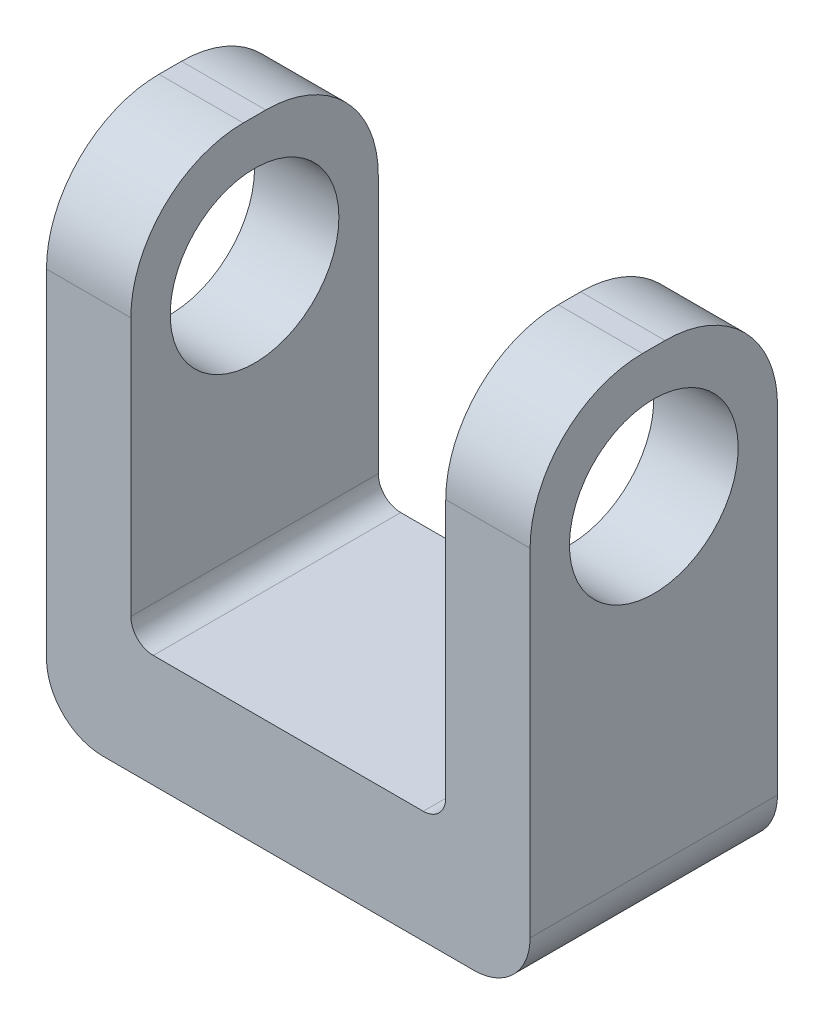
ISO-10303-21;
HEADER;
FILE_DESCRIPTION(('STEP AP214'),'2;1');
FILE_NAME('part.step','',(''),(''),'','','');
FILE_SCHEMA(('AUTOMOTIVE_DESIGN { 1 0 10303 214 1 1 1 1 }'));
ENDSEC;
DATA;
#1=APPLICATION_CONTEXT('core data for automotive mechanical design processes');
#2=APPLICATION_PROTOCOL_DEFINITION('international standard','automotive_design',2000,#1);
#3=PRODUCT_CONTEXT('',#1,'mechanical');
#4=PRODUCT('Part','Part','',(#3));
#5=PRODUCT_RELATED_PRODUCT_CATEGORY('part','',(#4));
#6=PRODUCT_DEFINITION_FORMATION('','',#4);
#7=PRODUCT_DEFINITION_CONTEXT('part definition',#1,'design');
#8=PRODUCT_DEFINITION('design','',#6,#7);
#9=PRODUCT_DEFINITION_SHAPE('','',#8);
#10=(LENGTH_UNIT() NAMED_UNIT(*) SI_UNIT(.MILLI.,.METRE.));
#11=(NAMED_UNIT(*) PLANE_ANGLE_UNIT() SI_UNIT($,.RADIAN.));
#12=(NAMED_UNIT(*) SI_UNIT($,.STERADIAN.) SOLID_ANGLE_UNIT());
#13=UNCERTAINTY_MEASURE_WITH_UNIT(LENGTH_MEASURE(1.E-05),#10,'distance_accuracy_value','');
#14=(GEOMETRIC_REPRESENTATION_CONTEXT(3) GLOBAL_UNCERTAINTY_ASSIGNED_CONTEXT((#13)) GLOBAL_UNIT_ASSIGNED_CONTEXT((#10,
#11,#12)) REPRESENTATION_CONTEXT('',''));
#15=CARTESIAN_POINT('',(0.,0.,0.));
#16=DIRECTION('',(0.,0.,1.));
#17=DIRECTION('',(1.,0.,0.));
#18=AXIS2_PLACEMENT_3D('',#15,#16,#17);
#19=CARTESIAN_POINT('',(-21.5,45.,22.));
#20=DIRECTION('',(0.,-1.,0.));
#21=DIRECTION('',(1.,0.,0.));
#22=AXIS2_PLACEMENT_3D('',#19,#20,#21);
#23=PLANE('',#22);
#24=DIRECTION('',(0.,0.,-1.));
#25=VECTOR('',#24,1.);
#26=CARTESIAN_POINT('',(14.,45.,63.));
#27=LINE('',#26,#25);
#28=CARTESIAN_POINT('',(14.,45.,12.));
#29=VERTEX_POINT('',#28);
#30=CARTESIAN_POINT('',(14.,45.,10.));
#31=VERTEX_POINT('',#30);
#32=EDGE_CURVE('E293',#29,#31,#27,.T.);
#33=ORIENTED_EDGE('',*,*,#32,.F.);
#34=DIRECTION('',(-1.,0.,0.));
#35=VECTOR('',#34,1.);
#36=CARTESIAN_POINT('',(-21.5,45.,12.));
#37=LINE('',#36,#35);
#38=CARTESIAN_POINT('',(21.5,45.,12.));
#39=VERTEX_POINT('',#38);
#40=EDGE_CURVE('E169',#29,#39,#37,.F.);
#41=ORIENTED_EDGE('',*,*,#40,.T.);
#42=DIRECTION('',(0.,0.,-1.));
#43=VECTOR('',#42,1.);
#44=CARTESIAN_POINT('',(21.5,45.,22.));
#45=LINE('',#44,#43);
#46=CARTESIAN_POINT('',(21.5,45.,10.));
#47=VERTEX_POINT('',#46);
#48=EDGE_CURVE('E181',#39,#47,#45,.T.);
#49=ORIENTED_EDGE('',*,*,#48,.T.);
#50=DIRECTION('',(-1.,0.,0.));
#51=VECTOR('',#50,1.);
#52=CARTESIAN_POINT('',(14.,45.,10.));
#53=LINE('',#52,#51);
#54=EDGE_CURVE('E170',#47,#31,#53,.T.);
#55=ORIENTED_EDGE('',*,*,#54,.T.);
#56=EDGE_LOOP('',(#33,#41,#49,#55));
#57=FACE_BOUND('',#56,.T.);
#58=ADVANCED_FACE('F34',(#57),#23,.F.);
#59=DIRECTION('',(0.,0.,-1.));
#60=VECTOR('',#59,1.);
#61=CARTESIAN_POINT('',(-21.5,45.,22.));
#62=LINE('',#61,#60);
#63=CARTESIAN_POINT('',(-21.5,45.,12.));
#64=VERTEX_POINT('',#63);
#65=CARTESIAN_POINT('',(-21.5,45.,10.));
#66=VERTEX_POINT('',#65);
#67=EDGE_CURVE('E263',#64,#66,#62,.T.);
#68=ORIENTED_EDGE('',*,*,#67,.F.);
#69=DIRECTION('',(-1.,0.,0.));
#70=VECTOR('',#69,1.);
#71=CARTESIAN_POINT('',(-21.5,45.,12.));
#72=LINE('',#71,#70);
#73=CARTESIAN_POINT('',(-14.,45.,12.));
#74=VERTEX_POINT('',#73);
#75=EDGE_CURVE('E199',#64,#74,#72,.F.);
#76=ORIENTED_EDGE('',*,*,#75,.T.);
#77=DIRECTION('',(0.,0.,-1.));
#78=VECTOR('',#77,1.);
#79=CARTESIAN_POINT('',(-14.,45.,63.));
#80=LINE('',#79,#78);
#81=CARTESIAN_POINT('',(-14.,45.,10.));
#82=VERTEX_POINT('',#81);
#83=EDGE_CURVE('E290',#74,#82,#80,.T.);
#84=ORIENTED_EDGE('',*,*,#83,.T.);
#85=DIRECTION('',(-1.,0.,0.));
#86=VECTOR('',#85,1.);
#87=CARTESIAN_POINT('',(-21.5,45.,10.));
#88=LINE('',#87,#86);
#89=EDGE_CURVE('E196',#82,#66,#88,.T.);
#90=ORIENTED_EDGE('',*,*,#89,.T.);
#91=EDGE_LOOP('',(#68,#76,#84,#90));
#92=FACE_BOUND('',#91,.T.);
#93=ADVANCED_FACE('F335',(#92),#23,.F.);
#94=CARTESIAN_POINT('',(0.,0.,22.));
#95=DIRECTION('',(0.,0.,-1.));
#96=DIRECTION('',(-1.,0.,0.));
#97=AXIS2_PLACEMENT_3D('',#94,#95,#96);
#98=PLANE('',#97);
#99=DIRECTION('',(0.,-1.,0.));
#100=VECTOR('',#99,1.);
#101=CARTESIAN_POINT('',(-21.5,0.,22.));
#102=LINE('',#101,#100);
#103=CARTESIAN_POINT('',(-21.5,35.,22.));
#104=VERTEX_POINT('',#103);
#105=CARTESIAN_POINT('',(-21.5,5.,22.));
#106=VERTEX_POINT('',#105);
#107=EDGE_CURVE('E240',#104,#106,#102,.T.);
#108=ORIENTED_EDGE('',*,*,#107,.T.);
#109=CARTESIAN_POINT('',(-16.5,5.,22.));
#110=DIRECTION('',(0.,0.,-1.));
#111=DIRECTION('',(-1.,0.,0.));
#112=AXIS2_PLACEMENT_3D('',#109,#110,#111);
#113=CIRCLE('',#112,5.);
#114=CARTESIAN_POINT('',(-16.5,0.,22.));
#115=VERTEX_POINT('',#114);
#116=EDGE_CURVE('E42',#106,#115,#113,.F.);
#117=ORIENTED_EDGE('',*,*,#116,.T.);
#118=DIRECTION('',(1.,0.,0.));
#119=VECTOR('',#118,1.);
#120=CARTESIAN_POINT('',(-21.5,0.,22.));
#121=LINE('',#120,#119);
#122=CARTESIAN_POINT('',(16.5,0.,22.));
#123=VERTEX_POINT('',#122);
#124=EDGE_CURVE('E239',#115,#123,#121,.T.);
#125=ORIENTED_EDGE('',*,*,#124,.T.);
#126=CARTESIAN_POINT('',(16.5,5.00000000000001,22.));
#127=DIRECTION('',(0.,0.,-1.));
#128=DIRECTION('',(-1.,0.,0.));
#129=AXIS2_PLACEMENT_3D('',#126,#127,#128);
#130=CIRCLE('',#129,5.);
#131=CARTESIAN_POINT('',(21.5,5.00000000000001,22.));
#132=VERTEX_POINT('',#131);
#133=EDGE_CURVE('E49',#123,#132,#130,.F.);
#134=ORIENTED_EDGE('',*,*,#133,.T.);
#135=DIRECTION('',(0.,1.,0.));
#136=VECTOR('',#135,1.);
#137=CARTESIAN_POINT('',(21.5,0.,22.));
#138=LINE('',#137,#136);
#139=CARTESIAN_POINT('',(21.5,35.,22.));
#140=VERTEX_POINT('',#139);
#141=EDGE_CURVE('E174',#132,#140,#138,.T.);
#142=ORIENTED_EDGE('',*,*,#141,.T.);
#143=DIRECTION('',(-1.,0.,0.));
#144=VECTOR('',#143,1.);
#145=CARTESIAN_POINT('',(0.,35.,22.));
#146=LINE('',#145,#144);
#147=CARTESIAN_POINT('',(14.,35.,22.));
#148=VERTEX_POINT('',#147);
#149=EDGE_CURVE('E168',#140,#148,#146,.T.);
#150=ORIENTED_EDGE('',*,*,#149,.T.);
#151=DIRECTION('',(0.,1.,0.));
#152=VECTOR('',#151,1.);
#153=CARTESIAN_POINT('',(14.,0.,22.));
#154=LINE('',#153,#152);
#155=CARTESIAN_POINT('',(14.,12.,22.));
#156=VERTEX_POINT('',#155);
#157=EDGE_CURVE('E149',#156,#148,#154,.T.);
#158=ORIENTED_EDGE('',*,*,#157,.F.);
#159=CARTESIAN_POINT('',(12.,12.,22.));
#160=DIRECTION('',(0.,0.,-1.));
#161=DIRECTION('',(-1.,0.,0.));
#162=AXIS2_PLACEMENT_3D('',#159,#160,#161);
#163=CIRCLE('',#162,2.);
#164=CARTESIAN_POINT('',(12.,10.,22.));
#165=VERTEX_POINT('',#164);
#166=EDGE_CURVE('E221',#156,#165,#163,.T.);
#167=ORIENTED_EDGE('',*,*,#166,.T.);
#168=DIRECTION('',(1.,0.,0.));
#169=VECTOR('',#168,1.);
#170=CARTESIAN_POINT('',(0.,10.,22.));
#171=LINE('',#170,#169);
#172=CARTESIAN_POINT('',(-12.,9.99999999999999,22.));
#173=VERTEX_POINT('',#172);
#174=EDGE_CURVE('E295',#173,#165,#171,.T.);
#175=ORIENTED_EDGE('',*,*,#174,.F.);
#176=CARTESIAN_POINT('',(-12.,12.,22.));
#177=DIRECTION('',(0.,0.,-1.));
#178=DIRECTION('',(-1.,0.,0.));
#179=AXIS2_PLACEMENT_3D('',#176,#177,#178);
#180=CIRCLE('',#179,2.);
#181=CARTESIAN_POINT('',(-14.,12.,22.));
#182=VERTEX_POINT('',#181);
#183=EDGE_CURVE('E225',#173,#182,#180,.T.);
#184=ORIENTED_EDGE('',*,*,#183,.T.);
#185=DIRECTION('',(0.,-1.,0.));
#186=VECTOR('',#185,1.);
#187=CARTESIAN_POINT('',(-14.,0.,22.));
#188=LINE('',#187,#186);
#189=CARTESIAN_POINT('',(-14.,35.,22.));
#190=VERTEX_POINT('',#189);
#191=EDGE_CURVE('E161',#190,#182,#188,.T.);
#192=ORIENTED_EDGE('',*,*,#191,.F.);
#193=DIRECTION('',(-1.,0.,0.));
#194=VECTOR('',#193,1.);
#195=CARTESIAN_POINT('',(0.,35.,22.));
#196=LINE('',#195,#194);
#197=EDGE_CURVE('E176',#190,#104,#196,.T.);
#198=ORIENTED_EDGE('',*,*,#197,.T.);
#199=EDGE_LOOP('',(#108,#117,#125,#134,#142,#150,#158,#167,#175,#184,#192,#198));
#200=FACE_BOUND('',#199,.T.);
#201=ADVANCED_FACE('F173',(#200),#98,.F.);
#202=CARTESIAN_POINT('',(0.,0.,0.));
#203=DIRECTION('',(0.,0.,-1.));
#204=DIRECTION('',(-1.,0.,0.));
#205=AXIS2_PLACEMENT_3D('',#202,#203,#204);
#206=PLANE('',#205);
#207=DIRECTION('',(1.,0.,0.));
#208=VECTOR('',#207,1.);
#209=CARTESIAN_POINT('',(-21.5,0.,0.));
#210=LINE('',#209,#208);
#211=CARTESIAN_POINT('',(-16.5,0.,0.));
#212=VERTEX_POINT('',#211);
#213=CARTESIAN_POINT('',(16.5,0.,0.));
#214=VERTEX_POINT('',#213);
#215=EDGE_CURVE('E254',#212,#214,#210,.T.);
#216=ORIENTED_EDGE('',*,*,#215,.F.);
#217=CARTESIAN_POINT('',(-16.5,5.,0.));
#218=DIRECTION('',(0.,0.,-1.));
#219=DIRECTION('',(-1.,0.,0.));
#220=AXIS2_PLACEMENT_3D('',#217,#218,#219);
#221=CIRCLE('',#220,5.);
#222=CARTESIAN_POINT('',(-21.5,5.,0.));
#223=VERTEX_POINT('',#222);
#224=EDGE_CURVE('E234',#212,#223,#221,.T.);
#225=ORIENTED_EDGE('',*,*,#224,.T.);
#226=DIRECTION('',(0.,-1.,0.));
#227=VECTOR('',#226,1.);
#228=CARTESIAN_POINT('',(-21.5,0.,0.));
#229=LINE('',#228,#227);
#230=CARTESIAN_POINT('',(-21.5,35.,0.));
#231=VERTEX_POINT('',#230);
#232=EDGE_CURVE('E160',#231,#223,#229,.T.);
#233=ORIENTED_EDGE('',*,*,#232,.F.);
#234=DIRECTION('',(-1.,0.,0.));
#235=VECTOR('',#234,1.);
#236=CARTESIAN_POINT('',(-14.,35.,0.));
#237=LINE('',#236,#235);
#238=CARTESIAN_POINT('',(-14.,35.,0.));
#239=VERTEX_POINT('',#238);
#240=EDGE_CURVE('E208',#231,#239,#237,.F.);
#241=ORIENTED_EDGE('',*,*,#240,.T.);
#242=DIRECTION('',(0.,-1.,0.));
#243=VECTOR('',#242,1.);
#244=CARTESIAN_POINT('',(-14.,9.99999999999999,0.));
#245=LINE('',#244,#243);
#246=CARTESIAN_POINT('',(-14.,12.,0.));
#247=VERTEX_POINT('',#246);
#248=EDGE_CURVE('E284',#239,#247,#245,.T.);
#249=ORIENTED_EDGE('',*,*,#248,.T.);
#250=CARTESIAN_POINT('',(-12.,12.,0.));
#251=DIRECTION('',(0.,0.,-1.));
#252=DIRECTION('',(-1.,0.,0.));
#253=AXIS2_PLACEMENT_3D('',#250,#251,#252);
#254=CIRCLE('',#253,2.);
#255=CARTESIAN_POINT('',(-12.,9.99999999999999,0.));
#256=VERTEX_POINT('',#255);
#257=EDGE_CURVE('E223',#247,#256,#254,.F.);
#258=ORIENTED_EDGE('',*,*,#257,.T.);
#259=DIRECTION('',(1.,0.,0.));
#260=VECTOR('',#259,1.);
#261=CARTESIAN_POINT('',(14.,10.,0.));
#262=LINE('',#261,#260);
#263=CARTESIAN_POINT('',(12.,10.,0.));
#264=VERTEX_POINT('',#263);
#265=EDGE_CURVE('E287',#256,#264,#262,.T.);
#266=ORIENTED_EDGE('',*,*,#265,.T.);
#267=CARTESIAN_POINT('',(12.,12.,0.));
#268=DIRECTION('',(0.,0.,-1.));
#269=DIRECTION('',(-1.,0.,0.));
#270=AXIS2_PLACEMENT_3D('',#267,#268,#269);
#271=CIRCLE('',#270,2.);
#272=CARTESIAN_POINT('',(14.,12.,0.));
#273=VERTEX_POINT('',#272);
#274=EDGE_CURVE('E219',#264,#273,#271,.F.);
#275=ORIENTED_EDGE('',*,*,#274,.T.);
#276=DIRECTION('',(0.,1.,0.));
#277=VECTOR('',#276,1.);
#278=CARTESIAN_POINT('',(14.,10.,0.));
#279=LINE('',#278,#277);
#280=CARTESIAN_POINT('',(14.,35.,0.));
#281=VERTEX_POINT('',#280);
#282=EDGE_CURVE('E282',#273,#281,#279,.T.);
#283=ORIENTED_EDGE('',*,*,#282,.T.);
#284=DIRECTION('',(-1.,0.,0.));
#285=VECTOR('',#284,1.);
#286=CARTESIAN_POINT('',(21.5,35.,0.));
#287=LINE('',#286,#285);
#288=CARTESIAN_POINT('',(21.5,35.,0.));
#289=VERTEX_POINT('',#288);
#290=EDGE_CURVE('E205',#281,#289,#287,.F.);
#291=ORIENTED_EDGE('',*,*,#290,.T.);
#292=DIRECTION('',(0.,1.,0.));
#293=VECTOR('',#292,1.);
#294=CARTESIAN_POINT('',(21.5,0.,0.));
#295=LINE('',#294,#293);
#296=CARTESIAN_POINT('',(21.5,5.00000000000001,0.));
#297=VERTEX_POINT('',#296);
#298=EDGE_CURVE('E258',#297,#289,#295,.T.);
#299=ORIENTED_EDGE('',*,*,#298,.F.);
#300=CARTESIAN_POINT('',(16.5,5.00000000000001,0.));
#301=DIRECTION('',(0.,0.,-1.));
#302=DIRECTION('',(-1.,0.,0.));
#303=AXIS2_PLACEMENT_3D('',#300,#301,#302);
#304=CIRCLE('',#303,5.);
#305=EDGE_CURVE('E232',#297,#214,#304,.T.);
#306=ORIENTED_EDGE('',*,*,#305,.T.);
#307=EDGE_LOOP('',(#216,#225,#233,#241,#249,#258,#266,#275,#283,#291,#299,#306));
#308=FACE_BOUND('',#307,.T.);
#309=ADVANCED_FACE('F252',(#308),#206,.T.);
#310=CARTESIAN_POINT('',(-21.5,0.,22.));
#311=DIRECTION('',(1.,0.,0.));
#312=DIRECTION('',(0.,0.,-1.));
#313=AXIS2_PLACEMENT_3D('',#310,#311,#312);
#314=PLANE('',#313);
#315=CARTESIAN_POINT('',(-21.5,33.5,11.));
#316=DIRECTION('',(1.,0.,0.));
#317=DIRECTION('',(0.,0.,-1.));
#318=AXIS2_PLACEMENT_3D('',#315,#316,#317);
#319=CIRCLE('',#318,7.5);
#320=CARTESIAN_POINT('',(-21.5,33.5,3.5));
#321=VERTEX_POINT('',#320);
#322=EDGE_CURVE('E273',#321,#321,#319,.T.);
#323=ORIENTED_EDGE('',*,*,#322,.T.);
#324=EDGE_LOOP('',(#323));
#325=FACE_BOUND('',#324,.T.);
#326=ORIENTED_EDGE('',*,*,#232,.T.);
#327=DIRECTION('',(0.,0.,-1.));
#328=VECTOR('',#327,1.);
#329=CARTESIAN_POINT('',(-21.5,5.,22.));
#330=LINE('',#329,#328);
#331=EDGE_CURVE('E57',#223,#106,#330,.F.);
#332=ORIENTED_EDGE('',*,*,#331,.T.);
#333=ORIENTED_EDGE('',*,*,#107,.F.);
#334=CARTESIAN_POINT('',(-21.5,35.,12.));
#335=DIRECTION('',(1.,0.,0.));
#336=DIRECTION('',(0.,0.,-1.));
#337=AXIS2_PLACEMENT_3D('',#334,#335,#336);
#338=CIRCLE('',#337,10.);
#339=EDGE_CURVE('E194',#104,#64,#338,.F.);
#340=ORIENTED_EDGE('',*,*,#339,.T.);
#341=ORIENTED_EDGE('',*,*,#67,.T.);
#342=CARTESIAN_POINT('',(-21.5,35.,10.));
#343=DIRECTION('',(1.,0.,0.));
#344=DIRECTION('',(0.,0.,-1.));
#345=AXIS2_PLACEMENT_3D('',#342,#343,#344);
#346=CIRCLE('',#345,10.);
#347=EDGE_CURVE('E192',#66,#231,#346,.F.);
#348=ORIENTED_EDGE('',*,*,#347,.T.);
#349=EDGE_LOOP('',(#326,#332,#333,#340,#341,#348));
#350=FACE_BOUND('',#349,.T.);
#351=ADVANCED_FACE('F255',(#325,#350),#314,.F.);
#352=CARTESIAN_POINT('',(-21.5,0.,22.));
#353=DIRECTION('',(0.,1.,0.));
#354=DIRECTION('',(-1.,0.,0.));
#355=AXIS2_PLACEMENT_3D('',#352,#353,#354);
#356=PLANE('',#355);
#357=ORIENTED_EDGE('',*,*,#124,.F.);
#358=DIRECTION('',(0.,0.,-1.));
#359=VECTOR('',#358,1.);
#360=CARTESIAN_POINT('',(-16.5,0.,22.));
#361=LINE('',#360,#359);
#362=EDGE_CURVE('E229',#115,#212,#361,.T.);
#363=ORIENTED_EDGE('',*,*,#362,.T.);
#364=ORIENTED_EDGE('',*,*,#215,.T.);
#365=DIRECTION('',(0.,0.,-1.));
#366=VECTOR('',#365,1.);
#367=CARTESIAN_POINT('',(16.5,0.,22.));
#368=LINE('',#367,#366);
#369=EDGE_CURVE('E227',#214,#123,#368,.F.);
#370=ORIENTED_EDGE('',*,*,#369,.T.);
#371=EDGE_LOOP('',(#357,#363,#364,#370));
#372=FACE_BOUND('',#371,.T.);
#373=ADVANCED_FACE('F244',(#372),#356,.F.);
#374=CARTESIAN_POINT('',(21.5,0.,22.));
#375=DIRECTION('',(-1.,0.,0.));
#376=DIRECTION('',(0.,-1.,0.));
#377=AXIS2_PLACEMENT_3D('',#374,#375,#376);
#378=PLANE('',#377);
#379=CARTESIAN_POINT('',(21.5,33.5,11.));
#380=DIRECTION('',(1.,0.,0.));
#381=DIRECTION('',(0.,1.,0.));
#382=AXIS2_PLACEMENT_3D('',#379,#380,#381);
#383=CIRCLE('',#382,7.5);
#384=CARTESIAN_POINT('',(21.5,41.,11.));
#385=VERTEX_POINT('',#384);
#386=EDGE_CURVE('E269',#385,#385,#383,.T.);
#387=ORIENTED_EDGE('',*,*,#386,.F.);
#388=EDGE_LOOP('',(#387));
#389=FACE_BOUND('',#388,.T.);
#390=ORIENTED_EDGE('',*,*,#141,.F.);
#391=DIRECTION('',(0.,0.,-1.));
#392=VECTOR('',#391,1.);
#393=CARTESIAN_POINT('',(21.5,5.00000000000001,22.));
#394=LINE('',#393,#392);
#395=EDGE_CURVE('E11',#132,#297,#394,.T.);
#396=ORIENTED_EDGE('',*,*,#395,.T.);
#397=ORIENTED_EDGE('',*,*,#298,.T.);
#398=CARTESIAN_POINT('',(21.5,35.,10.));
#399=DIRECTION('',(-1.,0.,0.));
#400=DIRECTION('',(0.,-1.,0.));
#401=AXIS2_PLACEMENT_3D('',#398,#399,#400);
#402=CIRCLE('',#401,10.);
#403=EDGE_CURVE('E188',#289,#47,#402,.F.);
#404=ORIENTED_EDGE('',*,*,#403,.T.);
#405=ORIENTED_EDGE('',*,*,#48,.F.);
#406=CARTESIAN_POINT('',(21.5,35.,12.));
#407=DIRECTION('',(-1.,0.,0.));
#408=DIRECTION('',(0.,-1.,0.));
#409=AXIS2_PLACEMENT_3D('',#406,#407,#408);
#410=CIRCLE('',#409,10.);
#411=EDGE_CURVE('E190',#39,#140,#410,.F.);
#412=ORIENTED_EDGE('',*,*,#411,.T.);
#413=EDGE_LOOP('',(#390,#396,#397,#404,#405,#412));
#414=FACE_BOUND('',#413,.T.);
#415=ADVANCED_FACE('F326',(#389,#414),#378,.F.);
#416=CARTESIAN_POINT('',(14.,10.,63.));
#417=DIRECTION('',(-1.,0.,0.));
#418=DIRECTION('',(0.,-1.,0.));
#419=AXIS2_PLACEMENT_3D('',#416,#417,#418);
#420=PLANE('',#419);
#421=CARTESIAN_POINT('',(14.,33.5,11.));
#422=DIRECTION('',(-1.,0.,0.));
#423=DIRECTION('',(0.,-1.,0.));
#424=AXIS2_PLACEMENT_3D('',#421,#422,#423);
#425=CIRCLE('',#424,7.5);
#426=CARTESIAN_POINT('',(14.,26.,11.));
#427=VERTEX_POINT('',#426);
#428=EDGE_CURVE('E268',#427,#427,#425,.T.);
#429=ORIENTED_EDGE('',*,*,#428,.F.);
#430=EDGE_LOOP('',(#429));
#431=FACE_BOUND('',#430,.T.);
#432=ORIENTED_EDGE('',*,*,#282,.F.);
#433=DIRECTION('',(0.,0.,-1.));
#434=VECTOR('',#433,1.);
#435=CARTESIAN_POINT('',(14.,12.,22.));
#436=LINE('',#435,#434);
#437=EDGE_CURVE('E157',#273,#156,#436,.F.);
#438=ORIENTED_EDGE('',*,*,#437,.T.);
#439=ORIENTED_EDGE('',*,*,#157,.T.);
#440=CARTESIAN_POINT('',(14.,35.,12.));
#441=DIRECTION('',(-1.,0.,0.));
#442=DIRECTION('',(0.,-1.,0.));
#443=AXIS2_PLACEMENT_3D('',#440,#441,#442);
#444=CIRCLE('',#443,10.);
#445=EDGE_CURVE('E154',#148,#29,#444,.T.);
#446=ORIENTED_EDGE('',*,*,#445,.T.);
#447=ORIENTED_EDGE('',*,*,#32,.T.);
#448=CARTESIAN_POINT('',(14.,35.,10.));
#449=DIRECTION('',(-1.,0.,0.));
#450=DIRECTION('',(0.,-1.,0.));
#451=AXIS2_PLACEMENT_3D('',#448,#449,#450);
#452=CIRCLE('',#451,10.);
#453=EDGE_CURVE('E171',#31,#281,#452,.T.);
#454=ORIENTED_EDGE('',*,*,#453,.T.);
#455=EDGE_LOOP('',(#432,#438,#439,#446,#447,#454));
#456=FACE_BOUND('',#455,.T.);
#457=ADVANCED_FACE('F152',(#431,#456),#420,.T.);
#458=CARTESIAN_POINT('',(-14.,9.99999999999999,63.));
#459=DIRECTION('',(1.,0.,0.));
#460=DIRECTION('',(0.,0.,-1.));
#461=AXIS2_PLACEMENT_3D('',#458,#459,#460);
#462=PLANE('',#461);
#463=CARTESIAN_POINT('',(-14.,33.5,11.));
#464=DIRECTION('',(1.,0.,0.));
#465=DIRECTION('',(0.,0.,-1.));
#466=AXIS2_PLACEMENT_3D('',#463,#464,#465);
#467=CIRCLE('',#466,7.5);
#468=CARTESIAN_POINT('',(-14.,33.5,3.5));
#469=VERTEX_POINT('',#468);
#470=EDGE_CURVE('E266',#469,#469,#467,.T.);
#471=ORIENTED_EDGE('',*,*,#470,.F.);
#472=EDGE_LOOP('',(#471));
#473=FACE_BOUND('',#472,.T.);
#474=ORIENTED_EDGE('',*,*,#191,.T.);
#475=DIRECTION('',(0.,0.,-1.));
#476=VECTOR('',#475,1.);
#477=CARTESIAN_POINT('',(-14.,12.,0.));
#478=LINE('',#477,#476);
#479=EDGE_CURVE('E216',#182,#247,#478,.T.);
#480=ORIENTED_EDGE('',*,*,#479,.T.);
#481=ORIENTED_EDGE('',*,*,#248,.F.);
#482=CARTESIAN_POINT('',(-14.,35.,10.));
#483=DIRECTION('',(1.,0.,0.));
#484=DIRECTION('',(0.,0.,-1.));
#485=AXIS2_PLACEMENT_3D('',#482,#483,#484);
#486=CIRCLE('',#485,10.);
#487=EDGE_CURVE('E201',#239,#82,#486,.T.);
#488=ORIENTED_EDGE('',*,*,#487,.T.);
#489=ORIENTED_EDGE('',*,*,#83,.F.);
#490=CARTESIAN_POINT('',(-14.,35.,12.));
#491=DIRECTION('',(1.,0.,0.));
#492=DIRECTION('',(0.,0.,-1.));
#493=AXIS2_PLACEMENT_3D('',#490,#491,#492);
#494=CIRCLE('',#493,10.);
#495=EDGE_CURVE('E203',#74,#190,#494,.T.);
#496=ORIENTED_EDGE('',*,*,#495,.T.);
#497=EDGE_LOOP('',(#474,#480,#481,#488,#489,#496));
#498=FACE_BOUND('',#497,.T.);
#499=ADVANCED_FACE('F303',(#473,#498),#462,.T.);
#500=CARTESIAN_POINT('',(14.,10.,63.));
#501=DIRECTION('',(0.,1.,0.));
#502=DIRECTION('',(-1.,0.,0.));
#503=AXIS2_PLACEMENT_3D('',#500,#501,#502);
#504=PLANE('',#503);
#505=ORIENTED_EDGE('',*,*,#174,.T.);
#506=DIRECTION('',(0.,0.,-1.));
#507=VECTOR('',#506,1.);
#508=CARTESIAN_POINT('',(12.,10.,0.));
#509=LINE('',#508,#507);
#510=EDGE_CURVE('E212',#165,#264,#509,.T.);
#511=ORIENTED_EDGE('',*,*,#510,.T.);
#512=ORIENTED_EDGE('',*,*,#265,.F.);
#513=DIRECTION('',(0.,0.,-1.));
#514=VECTOR('',#513,1.);
#515=CARTESIAN_POINT('',(-12.,9.99999999999999,22.));
#516=LINE('',#515,#514);
#517=EDGE_CURVE('E210',#256,#173,#516,.F.);
#518=ORIENTED_EDGE('',*,*,#517,.T.);
#519=EDGE_LOOP('',(#505,#511,#512,#518));
#520=FACE_BOUND('',#519,.T.);
#521=ADVANCED_FACE('F314',(#520),#504,.T.);
#522=CARTESIAN_POINT('',(-41.5,33.5,11.));
#523=DIRECTION('',(1.,0.,0.));
#524=DIRECTION('',(0.,1.,0.));
#525=AXIS2_PLACEMENT_3D('',#522,#523,#524);
#526=CYLINDRICAL_SURFACE('',#525,7.5);
#527=ORIENTED_EDGE('',*,*,#470,.T.);
#528=EDGE_LOOP('',(#527));
#529=FACE_BOUND('',#528,.T.);
#530=ORIENTED_EDGE('',*,*,#322,.F.);
#531=EDGE_LOOP('',(#530));
#532=FACE_BOUND('',#531,.T.);
#533=ADVANCED_FACE('F475',(#529,#532),#526,.F.);
#534=ORIENTED_EDGE('',*,*,#428,.T.);
#535=EDGE_LOOP('',(#534));
#536=FACE_BOUND('',#535,.T.);
#537=ORIENTED_EDGE('',*,*,#386,.T.);
#538=EDGE_LOOP('',(#537));
#539=FACE_BOUND('',#538,.T.);
#540=ADVANCED_FACE('F356',(#536,#539),#526,.F.);
#541=CARTESIAN_POINT('',(0.,35.,12.));
#542=DIRECTION('',(-1.,0.,0.));
#543=DIRECTION('',(0.,-1.,0.));
#544=AXIS2_PLACEMENT_3D('',#541,#542,#543);
#545=CYLINDRICAL_SURFACE('',#544,10.);
#546=ORIENTED_EDGE('',*,*,#411,.F.);
#547=ORIENTED_EDGE('',*,*,#40,.F.);
#548=ORIENTED_EDGE('',*,*,#445,.F.);
#549=ORIENTED_EDGE('',*,*,#149,.F.);
#550=EDGE_LOOP('',(#546,#547,#548,#549));
#551=FACE_BOUND('',#550,.T.);
#552=ADVANCED_FACE('F167',(#551),#545,.T.);
#553=CARTESIAN_POINT('',(0.,35.,12.));
#554=DIRECTION('',(-1.,0.,0.));
#555=DIRECTION('',(0.,-1.,0.));
#556=AXIS2_PLACEMENT_3D('',#553,#554,#555);
#557=CYLINDRICAL_SURFACE('',#556,10.);
#558=ORIENTED_EDGE('',*,*,#495,.F.);
#559=ORIENTED_EDGE('',*,*,#75,.F.);
#560=ORIENTED_EDGE('',*,*,#339,.F.);
#561=ORIENTED_EDGE('',*,*,#197,.F.);
#562=EDGE_LOOP('',(#558,#559,#560,#561));
#563=FACE_BOUND('',#562,.T.);
#564=ADVANCED_FACE('F355',(#563),#557,.T.);
#565=CARTESIAN_POINT('',(-21.5,35.,10.));
#566=DIRECTION('',(1.,0.,0.));
#567=DIRECTION('',(0.,1.,0.));
#568=AXIS2_PLACEMENT_3D('',#565,#566,#567);
#569=CYLINDRICAL_SURFACE('',#568,10.);
#570=ORIENTED_EDGE('',*,*,#487,.F.);
#571=ORIENTED_EDGE('',*,*,#240,.F.);
#572=ORIENTED_EDGE('',*,*,#347,.F.);
#573=ORIENTED_EDGE('',*,*,#89,.F.);
#574=EDGE_LOOP('',(#570,#571,#572,#573));
#575=FACE_BOUND('',#574,.T.);
#576=ADVANCED_FACE('F359',(#575),#569,.T.);
#577=CARTESIAN_POINT('',(-21.5,35.,10.));
#578=DIRECTION('',(1.,0.,0.));
#579=DIRECTION('',(0.,1.,0.));
#580=AXIS2_PLACEMENT_3D('',#577,#578,#579);
#581=CYLINDRICAL_SURFACE('',#580,10.);
#582=ORIENTED_EDGE('',*,*,#403,.F.);
#583=ORIENTED_EDGE('',*,*,#290,.F.);
#584=ORIENTED_EDGE('',*,*,#453,.F.);
#585=ORIENTED_EDGE('',*,*,#54,.F.);
#586=EDGE_LOOP('',(#582,#583,#584,#585));
#587=FACE_BOUND('',#586,.T.);
#588=ADVANCED_FACE('F323',(#587),#581,.T.);
#589=CARTESIAN_POINT('',(12.,12.,63.));
#590=DIRECTION('',(0.,0.,1.));
#591=DIRECTION('',(1.,0.,0.));
#592=AXIS2_PLACEMENT_3D('',#589,#590,#591);
#593=CYLINDRICAL_SURFACE('',#592,2.);
#594=ORIENTED_EDGE('',*,*,#166,.F.);
#595=ORIENTED_EDGE('',*,*,#437,.F.);
#596=ORIENTED_EDGE('',*,*,#274,.F.);
#597=ORIENTED_EDGE('',*,*,#510,.F.);
#598=EDGE_LOOP('',(#594,#595,#596,#597));
#599=FACE_BOUND('',#598,.T.);
#600=ADVANCED_FACE('F318',(#599),#593,.F.);
#601=CARTESIAN_POINT('',(-12.,12.,63.));
#602=DIRECTION('',(0.,0.,1.));
#603=DIRECTION('',(1.,0.,0.));
#604=AXIS2_PLACEMENT_3D('',#601,#602,#603);
#605=CYLINDRICAL_SURFACE('',#604,2.);
#606=ORIENTED_EDGE('',*,*,#183,.F.);
#607=ORIENTED_EDGE('',*,*,#517,.F.);
#608=ORIENTED_EDGE('',*,*,#257,.F.);
#609=ORIENTED_EDGE('',*,*,#479,.F.);
#610=EDGE_LOOP('',(#606,#607,#608,#609));
#611=FACE_BOUND('',#610,.T.);
#612=ADVANCED_FACE('F310',(#611),#605,.F.);
#613=CARTESIAN_POINT('',(-16.5,5.,22.));
#614=DIRECTION('',(0.,0.,-1.));
#615=DIRECTION('',(-1.,0.,0.));
#616=AXIS2_PLACEMENT_3D('',#613,#614,#615);
#617=CYLINDRICAL_SURFACE('',#616,5.);
#618=ORIENTED_EDGE('',*,*,#116,.F.);
#619=ORIENTED_EDGE('',*,*,#331,.F.);
#620=ORIENTED_EDGE('',*,*,#224,.F.);
#621=ORIENTED_EDGE('',*,*,#362,.F.);
#622=EDGE_LOOP('',(#618,#619,#620,#621));
#623=FACE_BOUND('',#622,.T.);
#624=ADVANCED_FACE('F249',(#623),#617,.T.);
#625=CARTESIAN_POINT('',(16.5,5.00000000000001,22.));
#626=DIRECTION('',(0.,0.,-1.));
#627=DIRECTION('',(-1.,0.,0.));
#628=AXIS2_PLACEMENT_3D('',#625,#626,#627);
#629=CYLINDRICAL_SURFACE('',#628,5.);
#630=ORIENTED_EDGE('',*,*,#133,.F.);
#631=ORIENTED_EDGE('',*,*,#369,.F.);
#632=ORIENTED_EDGE('',*,*,#305,.F.);
#633=ORIENTED_EDGE('',*,*,#395,.F.);
#634=EDGE_LOOP('',(#630,#631,#632,#633));
#635=FACE_BOUND('',#634,.T.);
#636=ADVANCED_FACE('F36',(#635),#629,.T.);
#637=CLOSED_SHELL('',(#58,#93,#201,#309,#351,#373,#415,#457,#499,#521,#533,#540,#552,#564,#576,
#588,#600,#612,#624,#636));
#638=MANIFOLD_SOLID_BREP('B2',#637);
#639=ADVANCED_BREP_SHAPE_REPRESENTATION('',(#18,#638),#14);
#640=SHAPE_DEFINITION_REPRESENTATION(#9,#639);
ENDSEC;
END-ISO-10303-21;
